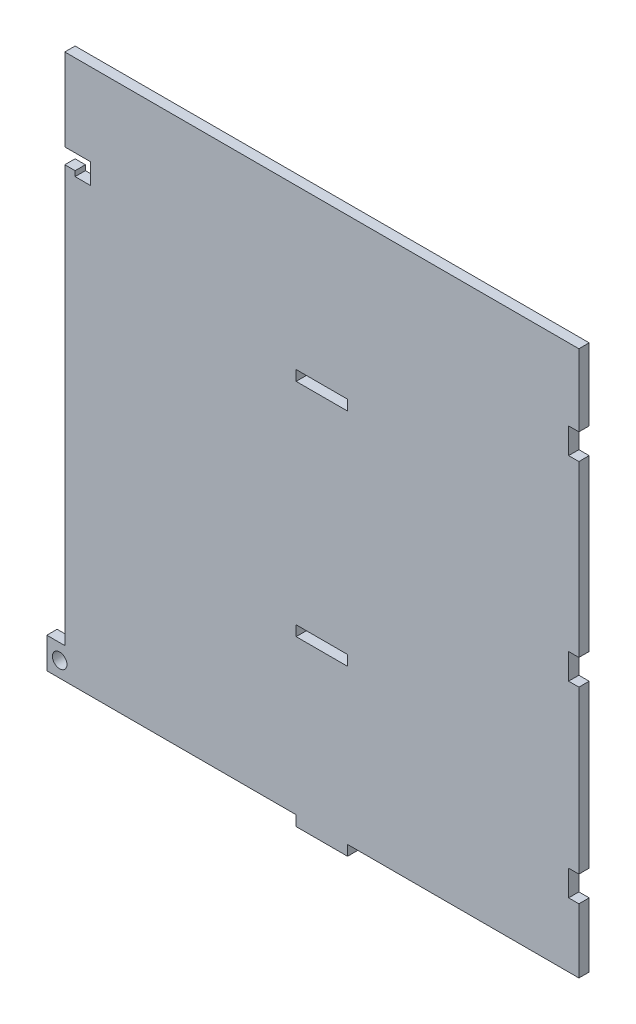
ISO-10303-21;
HEADER;
FILE_DESCRIPTION(('STEP AP214'),'2;1');
FILE_NAME('part.step','',(''),(''),'','','');
FILE_SCHEMA(('AUTOMOTIVE_DESIGN { 1 0 10303 214 1 1 1 1 }'));
ENDSEC;
DATA;
#1=APPLICATION_CONTEXT('core data for automotive mechanical design processes');
#2=APPLICATION_PROTOCOL_DEFINITION('international standard','automotive_design',2000,#1);
#3=PRODUCT_CONTEXT('',#1,'mechanical');
#4=PRODUCT('Part','Part','',(#3));
#5=PRODUCT_RELATED_PRODUCT_CATEGORY('part','',(#4));
#6=PRODUCT_DEFINITION_FORMATION('','',#4);
#7=PRODUCT_DEFINITION_CONTEXT('part definition',#1,'design');
#8=PRODUCT_DEFINITION('design','',#6,#7);
#9=PRODUCT_DEFINITION_SHAPE('','',#8);
#10=(LENGTH_UNIT() NAMED_UNIT(*) SI_UNIT(.MILLI.,.METRE.));
#11=(NAMED_UNIT(*) PLANE_ANGLE_UNIT() SI_UNIT($,.RADIAN.));
#12=(NAMED_UNIT(*) SI_UNIT($,.STERADIAN.) SOLID_ANGLE_UNIT());
#13=UNCERTAINTY_MEASURE_WITH_UNIT(LENGTH_MEASURE(1.E-05),#10,'distance_accuracy_value','');
#14=(GEOMETRIC_REPRESENTATION_CONTEXT(3) GLOBAL_UNCERTAINTY_ASSIGNED_CONTEXT((#13)) GLOBAL_UNIT_ASSIGNED_CONTEXT((#10,
#11,#12)) REPRESENTATION_CONTEXT('',''));
#15=CARTESIAN_POINT('',(0.,0.,0.));
#16=DIRECTION('',(0.,0.,1.));
#17=DIRECTION('',(1.,0.,0.));
#18=AXIS2_PLACEMENT_3D('',#15,#16,#17);
#19=CARTESIAN_POINT('',(0.,75.,2.));
#20=DIRECTION('',(0.,1.,0.));
#21=DIRECTION('',(0.,0.,1.));
#22=AXIS2_PLACEMENT_3D('',#19,#20,#21);
#23=PLANE('',#22);
#24=DIRECTION('',(1.,0.,0.));
#25=VECTOR('',#24,1.);
#26=CARTESIAN_POINT('',(0.,75.,0.));
#27=LINE('',#26,#25);
#28=CARTESIAN_POINT('',(-5.,75.,0.));
#29=VERTEX_POINT('',#28);
#30=CARTESIAN_POINT('',(5.,75.,0.));
#31=VERTEX_POINT('',#30);
#32=EDGE_CURVE('E397',#29,#31,#27,.T.);
#33=ORIENTED_EDGE('',*,*,#32,.T.);
#34=DIRECTION('',(0.,0.,-1.));
#35=VECTOR('',#34,1.);
#36=CARTESIAN_POINT('',(5.,75.,2.));
#37=LINE('',#36,#35);
#38=CARTESIAN_POINT('',(5.,75.,2.));
#39=VERTEX_POINT('',#38);
#40=EDGE_CURVE('E11',#39,#31,#37,.T.);
#41=ORIENTED_EDGE('',*,*,#40,.F.);
#42=DIRECTION('',(1.,0.,0.));
#43=VECTOR('',#42,1.);
#44=CARTESIAN_POINT('',(0.,75.,2.));
#45=LINE('',#44,#43);
#46=CARTESIAN_POINT('',(-5.,75.,2.));
#47=VERTEX_POINT('',#46);
#48=EDGE_CURVE('E283',#47,#39,#45,.T.);
#49=ORIENTED_EDGE('',*,*,#48,.F.);
#50=DIRECTION('',(0.,0.,-1.));
#51=VECTOR('',#50,1.);
#52=CARTESIAN_POINT('',(-5.,75.,2.));
#53=LINE('',#52,#51);
#54=EDGE_CURVE('E55',#47,#29,#53,.T.);
#55=ORIENTED_EDGE('',*,*,#54,.T.);
#56=EDGE_LOOP('',(#33,#41,#49,#55));
#57=FACE_BOUND('',#56,.T.);
#58=ADVANCED_FACE('F36',(#57),#23,.F.);
#59=CARTESIAN_POINT('',(5.00000000000003,0.,2.));
#60=DIRECTION('',(1.,0.,0.));
#61=DIRECTION('',(0.,1.,0.));
#62=AXIS2_PLACEMENT_3D('',#59,#60,#61);
#63=PLANE('',#62);
#64=DIRECTION('',(0.,-1.,0.));
#65=VECTOR('',#64,1.);
#66=CARTESIAN_POINT('',(5.00000000000003,0.,0.));
#67=LINE('',#66,#65);
#68=CARTESIAN_POINT('',(5.,73.,0.));
#69=VERTEX_POINT('',#68);
#70=EDGE_CURVE('E289',#31,#69,#67,.T.);
#71=ORIENTED_EDGE('',*,*,#70,.T.);
#72=DIRECTION('',(0.,0.,-1.));
#73=VECTOR('',#72,1.);
#74=CARTESIAN_POINT('',(5.,73.,2.));
#75=LINE('',#74,#73);
#76=CARTESIAN_POINT('',(5.,73.,2.));
#77=VERTEX_POINT('',#76);
#78=EDGE_CURVE('E46',#77,#69,#75,.T.);
#79=ORIENTED_EDGE('',*,*,#78,.F.);
#80=DIRECTION('',(0.,-1.,0.));
#81=VECTOR('',#80,1.);
#82=CARTESIAN_POINT('',(5.00000000000003,0.,2.));
#83=LINE('',#82,#81);
#84=EDGE_CURVE('E277',#39,#77,#83,.T.);
#85=ORIENTED_EDGE('',*,*,#84,.F.);
#86=ORIENTED_EDGE('',*,*,#40,.T.);
#87=EDGE_LOOP('',(#71,#79,#85,#86));
#88=FACE_BOUND('',#87,.T.);
#89=ADVANCED_FACE('F288',(#88),#63,.F.);
#90=CARTESIAN_POINT('',(0.,73.,2.));
#91=DIRECTION('',(0.,1.,0.));
#92=DIRECTION('',(0.,0.,1.));
#93=AXIS2_PLACEMENT_3D('',#90,#91,#92);
#94=PLANE('',#93);
#95=DIRECTION('',(1.,0.,0.));
#96=VECTOR('',#95,1.);
#97=CARTESIAN_POINT('',(0.,73.,0.));
#98=LINE('',#97,#96);
#99=CARTESIAN_POINT('',(-5.,73.,0.));
#100=VERTEX_POINT('',#99);
#101=EDGE_CURVE('E400',#100,#69,#98,.T.);
#102=ORIENTED_EDGE('',*,*,#101,.F.);
#103=DIRECTION('',(0.,0.,-1.));
#104=VECTOR('',#103,1.);
#105=CARTESIAN_POINT('',(-5.,73.,2.));
#106=LINE('',#105,#104);
#107=CARTESIAN_POINT('',(-5.,73.,2.));
#108=VERTEX_POINT('',#107);
#109=EDGE_CURVE('E165',#108,#100,#106,.T.);
#110=ORIENTED_EDGE('',*,*,#109,.F.);
#111=DIRECTION('',(1.,0.,0.));
#112=VECTOR('',#111,1.);
#113=CARTESIAN_POINT('',(0.,73.,2.));
#114=LINE('',#113,#112);
#115=EDGE_CURVE('E282',#108,#77,#114,.T.);
#116=ORIENTED_EDGE('',*,*,#115,.T.);
#117=ORIENTED_EDGE('',*,*,#78,.T.);
#118=EDGE_LOOP('',(#102,#110,#116,#117));
#119=FACE_BOUND('',#118,.T.);
#120=ADVANCED_FACE('F293',(#119),#94,.T.);
#121=CARTESIAN_POINT('',(0.,32.,2.));
#122=DIRECTION('',(0.,1.,0.));
#123=DIRECTION('',(0.,0.,1.));
#124=AXIS2_PLACEMENT_3D('',#121,#122,#123);
#125=PLANE('',#124);
#126=DIRECTION('',(1.,0.,0.));
#127=VECTOR('',#126,1.);
#128=CARTESIAN_POINT('',(0.,32.,0.));
#129=LINE('',#128,#127);
#130=CARTESIAN_POINT('',(-5.,32.,0.));
#131=VERTEX_POINT('',#130);
#132=CARTESIAN_POINT('',(4.99999999999999,32.,0.));
#133=VERTEX_POINT('',#132);
#134=EDGE_CURVE('E385',#131,#133,#129,.T.);
#135=ORIENTED_EDGE('',*,*,#134,.T.);
#136=DIRECTION('',(0.,0.,-1.));
#137=VECTOR('',#136,1.);
#138=CARTESIAN_POINT('',(4.99999999999999,32.,2.));
#139=LINE('',#138,#137);
#140=CARTESIAN_POINT('',(4.99999999999999,32.,2.));
#141=VERTEX_POINT('',#140);
#142=EDGE_CURVE('E407',#141,#133,#139,.T.);
#143=ORIENTED_EDGE('',*,*,#142,.F.);
#144=DIRECTION('',(1.,0.,0.));
#145=VECTOR('',#144,1.);
#146=CARTESIAN_POINT('',(0.,32.,2.));
#147=LINE('',#146,#145);
#148=CARTESIAN_POINT('',(-5.,32.,2.));
#149=VERTEX_POINT('',#148);
#150=EDGE_CURVE('E580',#149,#141,#147,.T.);
#151=ORIENTED_EDGE('',*,*,#150,.F.);
#152=DIRECTION('',(0.,0.,-1.));
#153=VECTOR('',#152,1.);
#154=CARTESIAN_POINT('',(-5.,32.,2.));
#155=LINE('',#154,#153);
#156=EDGE_CURVE('E409',#149,#131,#155,.T.);
#157=ORIENTED_EDGE('',*,*,#156,.T.);
#158=EDGE_LOOP('',(#135,#143,#151,#157));
#159=FACE_BOUND('',#158,.T.);
#160=ADVANCED_FACE('F604',(#159),#125,.F.);
#161=CARTESIAN_POINT('',(4.99999999999999,0.,2.));
#162=DIRECTION('',(1.,0.,0.));
#163=DIRECTION('',(0.,0.,-1.));
#164=AXIS2_PLACEMENT_3D('',#161,#162,#163);
#165=PLANE('',#164);
#166=DIRECTION('',(0.,-1.,0.));
#167=VECTOR('',#166,1.);
#168=CARTESIAN_POINT('',(4.99999999999999,0.,0.));
#169=LINE('',#168,#167);
#170=CARTESIAN_POINT('',(4.99999999999999,30.,0.));
#171=VERTEX_POINT('',#170);
#172=EDGE_CURVE('E388',#133,#171,#169,.T.);
#173=ORIENTED_EDGE('',*,*,#172,.T.);
#174=DIRECTION('',(0.,0.,-1.));
#175=VECTOR('',#174,1.);
#176=CARTESIAN_POINT('',(4.99999999999999,30.,2.));
#177=LINE('',#176,#175);
#178=CARTESIAN_POINT('',(4.99999999999999,30.,2.));
#179=VERTEX_POINT('',#178);
#180=EDGE_CURVE('E413',#179,#171,#177,.T.);
#181=ORIENTED_EDGE('',*,*,#180,.F.);
#182=DIRECTION('',(0.,-1.,0.));
#183=VECTOR('',#182,1.);
#184=CARTESIAN_POINT('',(4.99999999999999,0.,2.));
#185=LINE('',#184,#183);
#186=EDGE_CURVE('E583',#141,#179,#185,.T.);
#187=ORIENTED_EDGE('',*,*,#186,.F.);
#188=ORIENTED_EDGE('',*,*,#142,.T.);
#189=EDGE_LOOP('',(#173,#181,#187,#188));
#190=FACE_BOUND('',#189,.T.);
#191=ADVANCED_FACE('F606',(#190),#165,.F.);
#192=CARTESIAN_POINT('',(0.,30.,2.));
#193=DIRECTION('',(0.,1.,0.));
#194=DIRECTION('',(0.,0.,1.));
#195=AXIS2_PLACEMENT_3D('',#192,#193,#194);
#196=PLANE('',#195);
#197=DIRECTION('',(1.,0.,0.));
#198=VECTOR('',#197,1.);
#199=CARTESIAN_POINT('',(0.,30.,0.));
#200=LINE('',#199,#198);
#201=CARTESIAN_POINT('',(-5.,30.,0.));
#202=VERTEX_POINT('',#201);
#203=EDGE_CURVE('E391',#202,#171,#200,.T.);
#204=ORIENTED_EDGE('',*,*,#203,.F.);
#205=DIRECTION('',(0.,0.,-1.));
#206=VECTOR('',#205,1.);
#207=CARTESIAN_POINT('',(-5.,30.,2.));
#208=LINE('',#207,#206);
#209=CARTESIAN_POINT('',(-5.,30.,2.));
#210=VERTEX_POINT('',#209);
#211=EDGE_CURVE('E411',#210,#202,#208,.T.);
#212=ORIENTED_EDGE('',*,*,#211,.F.);
#213=DIRECTION('',(1.,0.,0.));
#214=VECTOR('',#213,1.);
#215=CARTESIAN_POINT('',(0.,30.,2.));
#216=LINE('',#215,#214);
#217=EDGE_CURVE('E585',#210,#179,#216,.T.);
#218=ORIENTED_EDGE('',*,*,#217,.T.);
#219=ORIENTED_EDGE('',*,*,#180,.T.);
#220=EDGE_LOOP('',(#204,#212,#218,#219));
#221=FACE_BOUND('',#220,.T.);
#222=ADVANCED_FACE('F600',(#221),#196,.T.);
#223=CARTESIAN_POINT('',(-45.,0.,2.));
#224=DIRECTION('',(-1.,0.,0.));
#225=DIRECTION('',(0.,0.,1.));
#226=AXIS2_PLACEMENT_3D('',#223,#224,#225);
#227=PLANE('',#226);
#228=DIRECTION('',(0.,1.,0.));
#229=VECTOR('',#228,1.);
#230=CARTESIAN_POINT('',(-45.,0.,0.));
#231=LINE('',#230,#229);
#232=CARTESIAN_POINT('',(-45.,86.,0.));
#233=VERTEX_POINT('',#232);
#234=CARTESIAN_POINT('',(-45.,90.,0.));
#235=VERTEX_POINT('',#234);
#236=EDGE_CURVE('E303',#233,#235,#231,.T.);
#237=ORIENTED_EDGE('',*,*,#236,.F.);
#238=DIRECTION('',(0.,0.,-1.));
#239=VECTOR('',#238,1.);
#240=CARTESIAN_POINT('',(-45.,86.,2.));
#241=LINE('',#240,#239);
#242=CARTESIAN_POINT('',(-45.,86.,2.));
#243=VERTEX_POINT('',#242);
#244=EDGE_CURVE('E40',#243,#233,#241,.T.);
#245=ORIENTED_EDGE('',*,*,#244,.F.);
#246=DIRECTION('',(0.,1.,0.));
#247=VECTOR('',#246,1.);
#248=CARTESIAN_POINT('',(-45.,0.,2.));
#249=LINE('',#248,#247);
#250=CARTESIAN_POINT('',(-45.,90.,2.));
#251=VERTEX_POINT('',#250);
#252=EDGE_CURVE('E1035',#243,#251,#249,.T.);
#253=ORIENTED_EDGE('',*,*,#252,.T.);
#254=DIRECTION('',(0.,0.,-1.));
#255=VECTOR('',#254,1.);
#256=CARTESIAN_POINT('',(-45.,90.,2.));
#257=LINE('',#256,#255);
#258=EDGE_CURVE('E296',#251,#235,#257,.T.);
#259=ORIENTED_EDGE('',*,*,#258,.T.);
#260=EDGE_LOOP('',(#237,#245,#253,#259));
#261=FACE_BOUND('',#260,.T.);
#262=ADVANCED_FACE('F491',(#261),#227,.T.);
#263=CARTESIAN_POINT('',(0.,86.,2.));
#264=DIRECTION('',(0.,1.,0.));
#265=DIRECTION('',(0.,0.,1.));
#266=AXIS2_PLACEMENT_3D('',#263,#264,#265);
#267=PLANE('',#266);
#268=DIRECTION('',(1.,0.,0.));
#269=VECTOR('',#268,1.);
#270=CARTESIAN_POINT('',(0.,86.,0.));
#271=LINE('',#270,#269);
#272=CARTESIAN_POINT('',(-48.,86.,0.));
#273=VERTEX_POINT('',#272);
#274=EDGE_CURVE('E306',#273,#233,#271,.T.);
#275=ORIENTED_EDGE('',*,*,#274,.F.);
#276=DIRECTION('',(0.,0.,-1.));
#277=VECTOR('',#276,1.);
#278=CARTESIAN_POINT('',(-48.,86.,2.));
#279=LINE('',#278,#277);
#280=CARTESIAN_POINT('',(-48.,86.,2.));
#281=VERTEX_POINT('',#280);
#282=EDGE_CURVE('E481',#281,#273,#279,.T.);
#283=ORIENTED_EDGE('',*,*,#282,.F.);
#284=DIRECTION('',(1.,0.,0.));
#285=VECTOR('',#284,1.);
#286=CARTESIAN_POINT('',(0.,86.,2.));
#287=LINE('',#286,#285);
#288=EDGE_CURVE('E490',#281,#243,#287,.T.);
#289=ORIENTED_EDGE('',*,*,#288,.T.);
#290=ORIENTED_EDGE('',*,*,#244,.T.);
#291=EDGE_LOOP('',(#275,#283,#289,#290));
#292=FACE_BOUND('',#291,.T.);
#293=ADVANCED_FACE('F488',(#292),#267,.T.);
#294=CARTESIAN_POINT('',(-48.,0.,2.));
#295=DIRECTION('',(1.,0.,0.));
#296=DIRECTION('',(0.,0.,-1.));
#297=AXIS2_PLACEMENT_3D('',#294,#295,#296);
#298=PLANE('',#297);
#299=DIRECTION('',(0.,-1.,0.));
#300=VECTOR('',#299,1.);
#301=CARTESIAN_POINT('',(-48.,0.,0.));
#302=LINE('',#301,#300);
#303=CARTESIAN_POINT('',(-48.,87.,0.));
#304=VERTEX_POINT('',#303);
#305=EDGE_CURVE('E309',#304,#273,#302,.T.);
#306=ORIENTED_EDGE('',*,*,#305,.F.);
#307=DIRECTION('',(0.,0.,-1.));
#308=VECTOR('',#307,1.);
#309=CARTESIAN_POINT('',(-48.,87.,2.));
#310=LINE('',#309,#308);
#311=CARTESIAN_POINT('',(-48.,87.,2.));
#312=VERTEX_POINT('',#311);
#313=EDGE_CURVE('E480',#312,#304,#310,.T.);
#314=ORIENTED_EDGE('',*,*,#313,.F.);
#315=DIRECTION('',(0.,-1.,0.));
#316=VECTOR('',#315,1.);
#317=CARTESIAN_POINT('',(-48.,0.,2.));
#318=LINE('',#317,#316);
#319=EDGE_CURVE('E499',#312,#281,#318,.T.);
#320=ORIENTED_EDGE('',*,*,#319,.T.);
#321=ORIENTED_EDGE('',*,*,#282,.T.);
#322=EDGE_LOOP('',(#306,#314,#320,#321));
#323=FACE_BOUND('',#322,.T.);
#324=ADVANCED_FACE('F497',(#323),#298,.T.);
#325=CARTESIAN_POINT('',(0.,87.,2.));
#326=DIRECTION('',(0.,1.,0.));
#327=DIRECTION('',(0.,0.,1.));
#328=AXIS2_PLACEMENT_3D('',#325,#326,#327);
#329=PLANE('',#328);
#330=DIRECTION('',(1.,0.,0.));
#331=VECTOR('',#330,1.);
#332=CARTESIAN_POINT('',(0.,87.,0.));
#333=LINE('',#332,#331);
#334=CARTESIAN_POINT('',(-50.,87.,0.));
#335=VERTEX_POINT('',#334);
#336=EDGE_CURVE('E312',#335,#304,#333,.T.);
#337=ORIENTED_EDGE('',*,*,#336,.F.);
#338=DIRECTION('',(0.,0.,-1.));
#339=VECTOR('',#338,1.);
#340=CARTESIAN_POINT('',(-50.,87.,2.));
#341=LINE('',#340,#339);
#342=CARTESIAN_POINT('',(-50.,87.,2.));
#343=VERTEX_POINT('',#342);
#344=EDGE_CURVE('E478',#343,#335,#341,.T.);
#345=ORIENTED_EDGE('',*,*,#344,.F.);
#346=DIRECTION('',(1.,0.,0.));
#347=VECTOR('',#346,1.);
#348=CARTESIAN_POINT('',(0.,87.,2.));
#349=LINE('',#348,#347);
#350=EDGE_CURVE('E506',#343,#312,#349,.T.);
#351=ORIENTED_EDGE('',*,*,#350,.T.);
#352=ORIENTED_EDGE('',*,*,#313,.T.);
#353=EDGE_LOOP('',(#337,#345,#351,#352));
#354=FACE_BOUND('',#353,.T.);
#355=ADVANCED_FACE('F509',(#354),#329,.T.);
#356=CARTESIAN_POINT('',(-50.,0.,2.));
#357=DIRECTION('',(-1.,0.,0.));
#358=DIRECTION('',(0.,0.,1.));
#359=AXIS2_PLACEMENT_3D('',#356,#357,#358);
#360=PLANE('',#359);
#361=DIRECTION('',(0.,1.,0.));
#362=VECTOR('',#361,1.);
#363=CARTESIAN_POINT('',(-50.,0.,0.));
#364=LINE('',#363,#362);
#365=CARTESIAN_POINT('',(-50.,6.,0.));
#366=VERTEX_POINT('',#365);
#367=EDGE_CURVE('E315',#366,#335,#364,.T.);
#368=ORIENTED_EDGE('',*,*,#367,.F.);
#369=DIRECTION('',(0.,0.,-1.));
#370=VECTOR('',#369,1.);
#371=CARTESIAN_POINT('',(-50.,6.,2.));
#372=LINE('',#371,#370);
#373=CARTESIAN_POINT('',(-50.,6.,2.));
#374=VERTEX_POINT('',#373);
#375=EDGE_CURVE('E476',#374,#366,#372,.T.);
#376=ORIENTED_EDGE('',*,*,#375,.F.);
#377=DIRECTION('',(0.,1.,0.));
#378=VECTOR('',#377,1.);
#379=CARTESIAN_POINT('',(-50.,0.,2.));
#380=LINE('',#379,#378);
#381=EDGE_CURVE('E510',#374,#343,#380,.T.);
#382=ORIENTED_EDGE('',*,*,#381,.T.);
#383=ORIENTED_EDGE('',*,*,#344,.T.);
#384=EDGE_LOOP('',(#368,#376,#382,#383));
#385=FACE_BOUND('',#384,.T.);
#386=ADVANCED_FACE('F718',(#385),#360,.T.);
#387=CARTESIAN_POINT('',(0.,6.,2.));
#388=DIRECTION('',(0.,1.,0.));
#389=DIRECTION('',(0.,0.,1.));
#390=AXIS2_PLACEMENT_3D('',#387,#388,#389);
#391=PLANE('',#390);
#392=DIRECTION('',(1.,0.,0.));
#393=VECTOR('',#392,1.);
#394=CARTESIAN_POINT('',(0.,6.,0.));
#395=LINE('',#394,#393);
#396=CARTESIAN_POINT('',(-53.5,6.,0.));
#397=VERTEX_POINT('',#396);
#398=EDGE_CURVE('E318',#397,#366,#395,.T.);
#399=ORIENTED_EDGE('',*,*,#398,.F.);
#400=DIRECTION('',(0.,0.,-1.));
#401=VECTOR('',#400,1.);
#402=CARTESIAN_POINT('',(-53.5,6.,2.));
#403=LINE('',#402,#401);
#404=CARTESIAN_POINT('',(-53.5,6.,2.));
#405=VERTEX_POINT('',#404);
#406=EDGE_CURVE('E474',#405,#397,#403,.T.);
#407=ORIENTED_EDGE('',*,*,#406,.F.);
#408=DIRECTION('',(1.,0.,0.));
#409=VECTOR('',#408,1.);
#410=CARTESIAN_POINT('',(0.,6.,2.));
#411=LINE('',#410,#409);
#412=EDGE_CURVE('E512',#405,#374,#411,.T.);
#413=ORIENTED_EDGE('',*,*,#412,.T.);
#414=ORIENTED_EDGE('',*,*,#375,.T.);
#415=EDGE_LOOP('',(#399,#407,#413,#414));
#416=FACE_BOUND('',#415,.T.);
#417=ADVANCED_FACE('F714',(#416),#391,.T.);
#418=CARTESIAN_POINT('',(-53.5,0.,2.));
#419=DIRECTION('',(-1.,0.,0.));
#420=DIRECTION('',(0.,0.,1.));
#421=AXIS2_PLACEMENT_3D('',#418,#419,#420);
#422=PLANE('',#421);
#423=DIRECTION('',(0.,1.,0.));
#424=VECTOR('',#423,1.);
#425=CARTESIAN_POINT('',(-53.5,0.,0.));
#426=LINE('',#425,#424);
#427=CARTESIAN_POINT('',(-53.5,0.,0.));
#428=VERTEX_POINT('',#427);
#429=EDGE_CURVE('E321',#428,#397,#426,.T.);
#430=ORIENTED_EDGE('',*,*,#429,.F.);
#431=DIRECTION('',(0.,0.,-1.));
#432=VECTOR('',#431,1.);
#433=CARTESIAN_POINT('',(-53.5,0.,2.));
#434=LINE('',#433,#432);
#435=CARTESIAN_POINT('',(-53.5,0.,2.));
#436=VERTEX_POINT('',#435);
#437=EDGE_CURVE('E472',#436,#428,#434,.T.);
#438=ORIENTED_EDGE('',*,*,#437,.F.);
#439=DIRECTION('',(0.,1.,0.));
#440=VECTOR('',#439,1.);
#441=CARTESIAN_POINT('',(-53.5,0.,2.));
#442=LINE('',#441,#440);
#443=EDGE_CURVE('E518',#436,#405,#442,.T.);
#444=ORIENTED_EDGE('',*,*,#443,.T.);
#445=ORIENTED_EDGE('',*,*,#406,.T.);
#446=EDGE_LOOP('',(#430,#438,#444,#445));
#447=FACE_BOUND('',#446,.T.);
#448=ADVANCED_FACE('F711',(#447),#422,.T.);
#449=CARTESIAN_POINT('',(0.,0.,2.));
#450=DIRECTION('',(0.,-1.,0.));
#451=DIRECTION('',(0.,0.,-1.));
#452=AXIS2_PLACEMENT_3D('',#449,#450,#451);
#453=PLANE('',#452);
#454=DIRECTION('',(-1.,0.,0.));
#455=VECTOR('',#454,1.);
#456=CARTESIAN_POINT('',(0.,0.,0.));
#457=LINE('',#456,#455);
#458=CARTESIAN_POINT('',(-5.,0.,0.));
#459=VERTEX_POINT('',#458);
#460=EDGE_CURVE('E324',#459,#428,#457,.T.);
#461=ORIENTED_EDGE('',*,*,#460,.F.);
#462=DIRECTION('',(0.,0.,-1.));
#463=VECTOR('',#462,1.);
#464=CARTESIAN_POINT('',(-5.,0.,2.));
#465=LINE('',#464,#463);
#466=CARTESIAN_POINT('',(-5.,0.,2.));
#467=VERTEX_POINT('',#466);
#468=EDGE_CURVE('E470',#467,#459,#465,.T.);
#469=ORIENTED_EDGE('',*,*,#468,.F.);
#470=DIRECTION('',(-1.,0.,0.));
#471=VECTOR('',#470,1.);
#472=CARTESIAN_POINT('',(0.,0.,2.));
#473=LINE('',#472,#471);
#474=EDGE_CURVE('E521',#467,#436,#473,.T.);
#475=ORIENTED_EDGE('',*,*,#474,.T.);
#476=ORIENTED_EDGE('',*,*,#437,.T.);
#477=EDGE_LOOP('',(#461,#469,#475,#476));
#478=FACE_BOUND('',#477,.T.);
#479=ADVANCED_FACE('F699',(#478),#453,.T.);
#480=CARTESIAN_POINT('',(-5.,0.,2.));
#481=DIRECTION('',(1.,0.,0.));
#482=DIRECTION('',(0.,0.,-1.));
#483=AXIS2_PLACEMENT_3D('',#480,#481,#482);
#484=PLANE('',#483);
#485=DIRECTION('',(0.,-1.,0.));
#486=VECTOR('',#485,1.);
#487=CARTESIAN_POINT('',(-5.,0.,0.));
#488=LINE('',#487,#486);
#489=CARTESIAN_POINT('',(-5.,-2.,0.));
#490=VERTEX_POINT('',#489);
#491=EDGE_CURVE('E327',#459,#490,#488,.T.);
#492=ORIENTED_EDGE('',*,*,#491,.T.);
#493=DIRECTION('',(0.,0.,-1.));
#494=VECTOR('',#493,1.);
#495=CARTESIAN_POINT('',(-5.,-2.,2.));
#496=LINE('',#495,#494);
#497=CARTESIAN_POINT('',(-5.,-2.,2.));
#498=VERTEX_POINT('',#497);
#499=EDGE_CURVE('E467',#498,#490,#496,.T.);
#500=ORIENTED_EDGE('',*,*,#499,.F.);
#501=DIRECTION('',(0.,-1.,0.));
#502=VECTOR('',#501,1.);
#503=CARTESIAN_POINT('',(-5.,0.,2.));
#504=LINE('',#503,#502);
#505=EDGE_CURVE('E524',#467,#498,#504,.T.);
#506=ORIENTED_EDGE('',*,*,#505,.F.);
#507=ORIENTED_EDGE('',*,*,#468,.T.);
#508=EDGE_LOOP('',(#492,#500,#506,#507));
#509=FACE_BOUND('',#508,.T.);
#510=ADVANCED_FACE('F706',(#509),#484,.F.);
#511=CARTESIAN_POINT('',(0.,-2.,2.));
#512=DIRECTION('',(0.,1.,0.));
#513=DIRECTION('',(-1.,0.,0.));
#514=AXIS2_PLACEMENT_3D('',#511,#512,#513);
#515=PLANE('',#514);
#516=DIRECTION('',(1.,0.,0.));
#517=VECTOR('',#516,1.);
#518=CARTESIAN_POINT('',(0.,-2.,0.));
#519=LINE('',#518,#517);
#520=CARTESIAN_POINT('',(5.,-2.,0.));
#521=VERTEX_POINT('',#520);
#522=EDGE_CURVE('E331',#490,#521,#519,.T.);
#523=ORIENTED_EDGE('',*,*,#522,.T.);
#524=DIRECTION('',(0.,0.,-1.));
#525=VECTOR('',#524,1.);
#526=CARTESIAN_POINT('',(5.,-2.,2.));
#527=LINE('',#526,#525);
#528=CARTESIAN_POINT('',(5.,-2.,2.));
#529=VERTEX_POINT('',#528);
#530=EDGE_CURVE('E464',#529,#521,#527,.T.);
#531=ORIENTED_EDGE('',*,*,#530,.F.);
#532=DIRECTION('',(1.,0.,0.));
#533=VECTOR('',#532,1.);
#534=CARTESIAN_POINT('',(0.,-2.,2.));
#535=LINE('',#534,#533);
#536=EDGE_CURVE('E528',#498,#529,#535,.T.);
#537=ORIENTED_EDGE('',*,*,#536,.F.);
#538=ORIENTED_EDGE('',*,*,#499,.T.);
#539=EDGE_LOOP('',(#523,#531,#537,#538));
#540=FACE_BOUND('',#539,.T.);
#541=ADVANCED_FACE('F702',(#540),#515,.F.);
#542=CARTESIAN_POINT('',(5.,0.,2.));
#543=DIRECTION('',(-1.,0.,0.));
#544=DIRECTION('',(0.,0.,1.));
#545=AXIS2_PLACEMENT_3D('',#542,#543,#544);
#546=PLANE('',#545);
#547=DIRECTION('',(0.,1.,0.));
#548=VECTOR('',#547,1.);
#549=CARTESIAN_POINT('',(5.,0.,0.));
#550=LINE('',#549,#548);
#551=CARTESIAN_POINT('',(5.,0.,0.));
#552=VERTEX_POINT('',#551);
#553=EDGE_CURVE('E334',#521,#552,#550,.T.);
#554=ORIENTED_EDGE('',*,*,#553,.T.);
#555=DIRECTION('',(0.,0.,-1.));
#556=VECTOR('',#555,1.);
#557=CARTESIAN_POINT('',(5.,0.,2.));
#558=LINE('',#557,#556);
#559=CARTESIAN_POINT('',(5.,0.,2.));
#560=VERTEX_POINT('',#559);
#561=EDGE_CURVE('E462',#560,#552,#558,.T.);
#562=ORIENTED_EDGE('',*,*,#561,.F.);
#563=DIRECTION('',(0.,1.,0.));
#564=VECTOR('',#563,1.);
#565=CARTESIAN_POINT('',(5.,0.,2.));
#566=LINE('',#565,#564);
#567=EDGE_CURVE('E531',#529,#560,#566,.T.);
#568=ORIENTED_EDGE('',*,*,#567,.F.);
#569=ORIENTED_EDGE('',*,*,#530,.T.);
#570=EDGE_LOOP('',(#554,#562,#568,#569));
#571=FACE_BOUND('',#570,.T.);
#572=ADVANCED_FACE('F697',(#571),#546,.F.);
#573=CARTESIAN_POINT('',(50.,0.,0.));
#574=VERTEX_POINT('',#573);
#575=EDGE_CURVE('E328',#574,#552,#457,.T.);
#576=ORIENTED_EDGE('',*,*,#575,.F.);
#577=DIRECTION('',(0.,0.,-1.));
#578=VECTOR('',#577,1.);
#579=CARTESIAN_POINT('',(50.,0.,2.));
#580=LINE('',#579,#578);
#581=CARTESIAN_POINT('',(50.,0.,2.));
#582=VERTEX_POINT('',#581);
#583=EDGE_CURVE('E460',#582,#574,#580,.T.);
#584=ORIENTED_EDGE('',*,*,#583,.F.);
#585=EDGE_CURVE('E525',#582,#560,#473,.T.);
#586=ORIENTED_EDGE('',*,*,#585,.T.);
#587=ORIENTED_EDGE('',*,*,#561,.T.);
#588=EDGE_LOOP('',(#576,#584,#586,#587));
#589=FACE_BOUND('',#588,.T.);
#590=ADVANCED_FACE('F693',(#589),#453,.T.);
#591=CARTESIAN_POINT('',(50.,0.,2.));
#592=DIRECTION('',(-1.,0.,0.));
#593=DIRECTION('',(0.,0.,1.));
#594=AXIS2_PLACEMENT_3D('',#591,#592,#593);
#595=PLANE('',#594);
#596=DIRECTION('',(0.,1.,0.));
#597=VECTOR('',#596,1.);
#598=CARTESIAN_POINT('',(50.,0.,0.));
#599=LINE('',#598,#597);
#600=CARTESIAN_POINT('',(50.,12.5,0.));
#601=VERTEX_POINT('',#600);
#602=EDGE_CURVE('E337',#574,#601,#599,.T.);
#603=ORIENTED_EDGE('',*,*,#602,.T.);
#604=DIRECTION('',(0.,0.,-1.));
#605=VECTOR('',#604,1.);
#606=CARTESIAN_POINT('',(50.,12.5,2.));
#607=LINE('',#606,#605);
#608=CARTESIAN_POINT('',(50.,12.5,2.));
#609=VERTEX_POINT('',#608);
#610=EDGE_CURVE('E457',#609,#601,#607,.T.);
#611=ORIENTED_EDGE('',*,*,#610,.F.);
#612=DIRECTION('',(0.,1.,0.));
#613=VECTOR('',#612,1.);
#614=CARTESIAN_POINT('',(50.,0.,2.));
#615=LINE('',#614,#613);
#616=EDGE_CURVE('E533',#582,#609,#615,.T.);
#617=ORIENTED_EDGE('',*,*,#616,.F.);
#618=ORIENTED_EDGE('',*,*,#583,.T.);
#619=EDGE_LOOP('',(#603,#611,#617,#618));
#620=FACE_BOUND('',#619,.T.);
#621=ADVANCED_FACE('F689',(#620),#595,.F.);
#622=CARTESIAN_POINT('',(0.,12.4999999999999,2.));
#623=DIRECTION('',(0.,-1.,0.));
#624=DIRECTION('',(1.,0.,0.));
#625=AXIS2_PLACEMENT_3D('',#622,#623,#624);
#626=PLANE('',#625);
#627=DIRECTION('',(-1.,0.,0.));
#628=VECTOR('',#627,1.);
#629=CARTESIAN_POINT('',(0.,12.4999999999999,0.));
#630=LINE('',#629,#628);
#631=CARTESIAN_POINT('',(48.,12.5,0.));
#632=VERTEX_POINT('',#631);
#633=EDGE_CURVE('E340',#601,#632,#630,.T.);
#634=ORIENTED_EDGE('',*,*,#633,.T.);
#635=DIRECTION('',(0.,0.,-1.));
#636=VECTOR('',#635,1.);
#637=CARTESIAN_POINT('',(48.,12.5,2.));
#638=LINE('',#637,#636);
#639=CARTESIAN_POINT('',(48.,12.5,2.));
#640=VERTEX_POINT('',#639);
#641=EDGE_CURVE('E454',#640,#632,#638,.T.);
#642=ORIENTED_EDGE('',*,*,#641,.F.);
#643=DIRECTION('',(-1.,0.,0.));
#644=VECTOR('',#643,1.);
#645=CARTESIAN_POINT('',(0.,12.4999999999999,2.));
#646=LINE('',#645,#644);
#647=EDGE_CURVE('E536',#609,#640,#646,.T.);
#648=ORIENTED_EDGE('',*,*,#647,.F.);
#649=ORIENTED_EDGE('',*,*,#610,.T.);
#650=EDGE_LOOP('',(#634,#642,#648,#649));
#651=FACE_BOUND('',#650,.T.);
#652=ADVANCED_FACE('F685',(#651),#626,.F.);
#653=CARTESIAN_POINT('',(48.,0.,2.));
#654=DIRECTION('',(-1.,0.,0.));
#655=DIRECTION('',(0.,0.,1.));
#656=AXIS2_PLACEMENT_3D('',#653,#654,#655);
#657=PLANE('',#656);
#658=DIRECTION('',(0.,1.,0.));
#659=VECTOR('',#658,1.);
#660=CARTESIAN_POINT('',(48.,0.,0.));
#661=LINE('',#660,#659);
#662=CARTESIAN_POINT('',(48.,17.5,0.));
#663=VERTEX_POINT('',#662);
#664=EDGE_CURVE('E343',#632,#663,#661,.T.);
#665=ORIENTED_EDGE('',*,*,#664,.T.);
#666=DIRECTION('',(0.,0.,-1.));
#667=VECTOR('',#666,1.);
#668=CARTESIAN_POINT('',(48.,17.5,2.));
#669=LINE('',#668,#667);
#670=CARTESIAN_POINT('',(48.,17.5,2.));
#671=VERTEX_POINT('',#670);
#672=EDGE_CURVE('E451',#671,#663,#669,.T.);
#673=ORIENTED_EDGE('',*,*,#672,.F.);
#674=DIRECTION('',(0.,1.,0.));
#675=VECTOR('',#674,1.);
#676=CARTESIAN_POINT('',(48.,0.,2.));
#677=LINE('',#676,#675);
#678=EDGE_CURVE('E539',#640,#671,#677,.T.);
#679=ORIENTED_EDGE('',*,*,#678,.F.);
#680=ORIENTED_EDGE('',*,*,#641,.T.);
#681=EDGE_LOOP('',(#665,#673,#679,#680));
#682=FACE_BOUND('',#681,.T.);
#683=ADVANCED_FACE('F681',(#682),#657,.F.);
#684=CARTESIAN_POINT('',(0.,17.5,2.));
#685=DIRECTION('',(0.,1.,0.));
#686=DIRECTION('',(0.,0.,1.));
#687=AXIS2_PLACEMENT_3D('',#684,#685,#686);
#688=PLANE('',#687);
#689=DIRECTION('',(1.,0.,0.));
#690=VECTOR('',#689,1.);
#691=CARTESIAN_POINT('',(0.,17.5,0.));
#692=LINE('',#691,#690);
#693=CARTESIAN_POINT('',(50.,17.5,0.));
#694=VERTEX_POINT('',#693);
#695=EDGE_CURVE('E346',#663,#694,#692,.T.);
#696=ORIENTED_EDGE('',*,*,#695,.T.);
#697=DIRECTION('',(0.,0.,-1.));
#698=VECTOR('',#697,1.);
#699=CARTESIAN_POINT('',(50.,17.5,2.));
#700=LINE('',#699,#698);
#701=CARTESIAN_POINT('',(50.,17.5,2.));
#702=VERTEX_POINT('',#701);
#703=EDGE_CURVE('E448',#702,#694,#700,.T.);
#704=ORIENTED_EDGE('',*,*,#703,.F.);
#705=DIRECTION('',(1.,0.,0.));
#706=VECTOR('',#705,1.);
#707=CARTESIAN_POINT('',(0.,17.5,2.));
#708=LINE('',#707,#706);
#709=EDGE_CURVE('E542',#671,#702,#708,.T.);
#710=ORIENTED_EDGE('',*,*,#709,.F.);
#711=ORIENTED_EDGE('',*,*,#672,.T.);
#712=EDGE_LOOP('',(#696,#704,#710,#711));
#713=FACE_BOUND('',#712,.T.);
#714=ADVANCED_FACE('F677',(#713),#688,.F.);
#715=CARTESIAN_POINT('',(50.,0.,2.));
#716=DIRECTION('',(-1.,0.,0.));
#717=DIRECTION('',(0.,0.,1.));
#718=AXIS2_PLACEMENT_3D('',#715,#716,#717);
#719=PLANE('',#718);
#720=DIRECTION('',(0.,1.,0.));
#721=VECTOR('',#720,1.);
#722=CARTESIAN_POINT('',(50.,0.,0.));
#723=LINE('',#722,#721);
#724=CARTESIAN_POINT('',(50.,49.,0.));
#725=VERTEX_POINT('',#724);
#726=EDGE_CURVE('E349',#694,#725,#723,.T.);
#727=ORIENTED_EDGE('',*,*,#726,.T.);
#728=DIRECTION('',(0.,0.,-1.));
#729=VECTOR('',#728,1.);
#730=CARTESIAN_POINT('',(50.,49.,2.));
#731=LINE('',#730,#729);
#732=CARTESIAN_POINT('',(50.,49.,2.));
#733=VERTEX_POINT('',#732);
#734=EDGE_CURVE('E445',#733,#725,#731,.T.);
#735=ORIENTED_EDGE('',*,*,#734,.F.);
#736=DIRECTION('',(0.,1.,0.));
#737=VECTOR('',#736,1.);
#738=CARTESIAN_POINT('',(50.,0.,2.));
#739=LINE('',#738,#737);
#740=EDGE_CURVE('E545',#702,#733,#739,.T.);
#741=ORIENTED_EDGE('',*,*,#740,.F.);
#742=ORIENTED_EDGE('',*,*,#703,.T.);
#743=EDGE_LOOP('',(#727,#735,#741,#742));
#744=FACE_BOUND('',#743,.T.);
#745=ADVANCED_FACE('F673',(#744),#719,.F.);
#746=CARTESIAN_POINT('',(-1.70002900645726E-13,48.9999999999998,2.));
#747=DIRECTION('',(0.,-1.,0.));
#748=DIRECTION('',(1.,0.,0.));
#749=AXIS2_PLACEMENT_3D('',#746,#747,#748);
#750=PLANE('',#749);
#751=DIRECTION('',(-1.,0.,0.));
#752=VECTOR('',#751,1.);
#753=CARTESIAN_POINT('',(-1.70002900645726E-13,48.9999999999998,0.));
#754=LINE('',#753,#752);
#755=CARTESIAN_POINT('',(48.,49.,0.));
#756=VERTEX_POINT('',#755);
#757=EDGE_CURVE('E352',#725,#756,#754,.T.);
#758=ORIENTED_EDGE('',*,*,#757,.T.);
#759=DIRECTION('',(0.,0.,-1.));
#760=VECTOR('',#759,1.);
#761=CARTESIAN_POINT('',(48.,49.,2.));
#762=LINE('',#761,#760);
#763=CARTESIAN_POINT('',(48.,49.,2.));
#764=VERTEX_POINT('',#763);
#765=EDGE_CURVE('E442',#764,#756,#762,.T.);
#766=ORIENTED_EDGE('',*,*,#765,.F.);
#767=DIRECTION('',(-1.,0.,0.));
#768=VECTOR('',#767,1.);
#769=CARTESIAN_POINT('',(-1.70002900645726E-13,48.9999999999998,2.));
#770=LINE('',#769,#768);
#771=EDGE_CURVE('E548',#733,#764,#770,.T.);
#772=ORIENTED_EDGE('',*,*,#771,.F.);
#773=ORIENTED_EDGE('',*,*,#734,.T.);
#774=EDGE_LOOP('',(#758,#766,#772,#773));
#775=FACE_BOUND('',#774,.T.);
#776=ADVANCED_FACE('F669',(#775),#750,.F.);
#777=CARTESIAN_POINT('',(48.,0.,2.));
#778=DIRECTION('',(-1.,0.,0.));
#779=DIRECTION('',(0.,0.,1.));
#780=AXIS2_PLACEMENT_3D('',#777,#778,#779);
#781=PLANE('',#780);
#782=DIRECTION('',(0.,1.,0.));
#783=VECTOR('',#782,1.);
#784=CARTESIAN_POINT('',(48.,0.,0.));
#785=LINE('',#784,#783);
#786=CARTESIAN_POINT('',(48.,54.,0.));
#787=VERTEX_POINT('',#786);
#788=EDGE_CURVE('E355',#756,#787,#785,.T.);
#789=ORIENTED_EDGE('',*,*,#788,.T.);
#790=DIRECTION('',(0.,0.,-1.));
#791=VECTOR('',#790,1.);
#792=CARTESIAN_POINT('',(48.,54.,2.));
#793=LINE('',#792,#791);
#794=CARTESIAN_POINT('',(48.,54.,2.));
#795=VERTEX_POINT('',#794);
#796=EDGE_CURVE('E439',#795,#787,#793,.T.);
#797=ORIENTED_EDGE('',*,*,#796,.F.);
#798=DIRECTION('',(0.,1.,0.));
#799=VECTOR('',#798,1.);
#800=CARTESIAN_POINT('',(48.,0.,2.));
#801=LINE('',#800,#799);
#802=EDGE_CURVE('E551',#764,#795,#801,.T.);
#803=ORIENTED_EDGE('',*,*,#802,.F.);
#804=ORIENTED_EDGE('',*,*,#765,.T.);
#805=EDGE_LOOP('',(#789,#797,#803,#804));
#806=FACE_BOUND('',#805,.T.);
#807=ADVANCED_FACE('F665',(#806),#781,.F.);
#808=CARTESIAN_POINT('',(0.,54.,2.));
#809=DIRECTION('',(0.,1.,0.));
#810=DIRECTION('',(0.,0.,1.));
#811=AXIS2_PLACEMENT_3D('',#808,#809,#810);
#812=PLANE('',#811);
#813=DIRECTION('',(1.,0.,0.));
#814=VECTOR('',#813,1.);
#815=CARTESIAN_POINT('',(0.,54.,0.));
#816=LINE('',#815,#814);
#817=CARTESIAN_POINT('',(50.,54.,0.));
#818=VERTEX_POINT('',#817);
#819=EDGE_CURVE('E358',#787,#818,#816,.T.);
#820=ORIENTED_EDGE('',*,*,#819,.T.);
#821=DIRECTION('',(0.,0.,-1.));
#822=VECTOR('',#821,1.);
#823=CARTESIAN_POINT('',(50.,54.,2.));
#824=LINE('',#823,#822);
#825=CARTESIAN_POINT('',(50.,54.,2.));
#826=VERTEX_POINT('',#825);
#827=EDGE_CURVE('E436',#826,#818,#824,.T.);
#828=ORIENTED_EDGE('',*,*,#827,.F.);
#829=DIRECTION('',(1.,0.,0.));
#830=VECTOR('',#829,1.);
#831=CARTESIAN_POINT('',(0.,54.,2.));
#832=LINE('',#831,#830);
#833=EDGE_CURVE('E554',#795,#826,#832,.T.);
#834=ORIENTED_EDGE('',*,*,#833,.F.);
#835=ORIENTED_EDGE('',*,*,#796,.T.);
#836=EDGE_LOOP('',(#820,#828,#834,#835));
#837=FACE_BOUND('',#836,.T.);
#838=ADVANCED_FACE('F661',(#837),#812,.F.);
#839=CARTESIAN_POINT('',(50.,0.,2.));
#840=DIRECTION('',(-1.,0.,0.));
#841=DIRECTION('',(0.,0.,1.));
#842=AXIS2_PLACEMENT_3D('',#839,#840,#841);
#843=PLANE('',#842);
#844=DIRECTION('',(0.,1.,0.));
#845=VECTOR('',#844,1.);
#846=CARTESIAN_POINT('',(50.,0.,0.));
#847=LINE('',#846,#845);
#848=CARTESIAN_POINT('',(50.,87.,0.));
#849=VERTEX_POINT('',#848);
#850=EDGE_CURVE('E361',#818,#849,#847,.T.);
#851=ORIENTED_EDGE('',*,*,#850,.T.);
#852=DIRECTION('',(0.,0.,-1.));
#853=VECTOR('',#852,1.);
#854=CARTESIAN_POINT('',(50.,87.,2.));
#855=LINE('',#854,#853);
#856=CARTESIAN_POINT('',(50.,87.,2.));
#857=VERTEX_POINT('',#856);
#858=EDGE_CURVE('E433',#857,#849,#855,.T.);
#859=ORIENTED_EDGE('',*,*,#858,.F.);
#860=DIRECTION('',(0.,1.,0.));
#861=VECTOR('',#860,1.);
#862=CARTESIAN_POINT('',(50.,0.,2.));
#863=LINE('',#862,#861);
#864=EDGE_CURVE('E557',#826,#857,#863,.T.);
#865=ORIENTED_EDGE('',*,*,#864,.F.);
#866=ORIENTED_EDGE('',*,*,#827,.T.);
#867=EDGE_LOOP('',(#851,#859,#865,#866));
#868=FACE_BOUND('',#867,.T.);
#869=ADVANCED_FACE('F657',(#868),#843,.F.);
#870=CARTESIAN_POINT('',(0.,87.,2.));
#871=DIRECTION('',(0.,-1.,0.));
#872=DIRECTION('',(0.,0.,-1.));
#873=AXIS2_PLACEMENT_3D('',#870,#871,#872);
#874=PLANE('',#873);
#875=DIRECTION('',(-1.,0.,0.));
#876=VECTOR('',#875,1.);
#877=CARTESIAN_POINT('',(0.,87.,0.));
#878=LINE('',#877,#876);
#879=CARTESIAN_POINT('',(48.,87.,0.));
#880=VERTEX_POINT('',#879);
#881=EDGE_CURVE('E364',#849,#880,#878,.T.);
#882=ORIENTED_EDGE('',*,*,#881,.T.);
#883=DIRECTION('',(0.,0.,-1.));
#884=VECTOR('',#883,1.);
#885=CARTESIAN_POINT('',(48.,87.,2.));
#886=LINE('',#885,#884);
#887=CARTESIAN_POINT('',(48.,87.,2.));
#888=VERTEX_POINT('',#887);
#889=EDGE_CURVE('E430',#888,#880,#886,.T.);
#890=ORIENTED_EDGE('',*,*,#889,.F.);
#891=DIRECTION('',(-1.,0.,0.));
#892=VECTOR('',#891,1.);
#893=CARTESIAN_POINT('',(0.,87.,2.));
#894=LINE('',#893,#892);
#895=EDGE_CURVE('E560',#857,#888,#894,.T.);
#896=ORIENTED_EDGE('',*,*,#895,.F.);
#897=ORIENTED_EDGE('',*,*,#858,.T.);
#898=EDGE_LOOP('',(#882,#890,#896,#897));
#899=FACE_BOUND('',#898,.T.);
#900=ADVANCED_FACE('F653',(#899),#874,.F.);
#901=CARTESIAN_POINT('',(48.,0.,2.));
#902=DIRECTION('',(-1.,0.,0.));
#903=DIRECTION('',(0.,0.,1.));
#904=AXIS2_PLACEMENT_3D('',#901,#902,#903);
#905=PLANE('',#904);
#906=DIRECTION('',(0.,1.,0.));
#907=VECTOR('',#906,1.);
#908=CARTESIAN_POINT('',(48.,0.,0.));
#909=LINE('',#908,#907);
#910=CARTESIAN_POINT('',(48.,92.,0.));
#911=VERTEX_POINT('',#910);
#912=EDGE_CURVE('E367',#880,#911,#909,.T.);
#913=ORIENTED_EDGE('',*,*,#912,.T.);
#914=DIRECTION('',(0.,0.,-1.));
#915=VECTOR('',#914,1.);
#916=CARTESIAN_POINT('',(48.,92.,2.));
#917=LINE('',#916,#915);
#918=CARTESIAN_POINT('',(48.,92.,2.));
#919=VERTEX_POINT('',#918);
#920=EDGE_CURVE('E427',#919,#911,#917,.T.);
#921=ORIENTED_EDGE('',*,*,#920,.F.);
#922=DIRECTION('',(0.,1.,0.));
#923=VECTOR('',#922,1.);
#924=CARTESIAN_POINT('',(48.,0.,2.));
#925=LINE('',#924,#923);
#926=EDGE_CURVE('E563',#888,#919,#925,.T.);
#927=ORIENTED_EDGE('',*,*,#926,.F.);
#928=ORIENTED_EDGE('',*,*,#889,.T.);
#929=EDGE_LOOP('',(#913,#921,#927,#928));
#930=FACE_BOUND('',#929,.T.);
#931=ADVANCED_FACE('F649',(#930),#905,.F.);
#932=CARTESIAN_POINT('',(0.,92.,2.));
#933=DIRECTION('',(0.,1.,0.));
#934=DIRECTION('',(0.,0.,1.));
#935=AXIS2_PLACEMENT_3D('',#932,#933,#934);
#936=PLANE('',#935);
#937=DIRECTION('',(1.,0.,0.));
#938=VECTOR('',#937,1.);
#939=CARTESIAN_POINT('',(0.,92.,0.));
#940=LINE('',#939,#938);
#941=CARTESIAN_POINT('',(50.,92.,0.));
#942=VERTEX_POINT('',#941);
#943=EDGE_CURVE('E370',#911,#942,#940,.T.);
#944=ORIENTED_EDGE('',*,*,#943,.T.);
#945=DIRECTION('',(0.,0.,-1.));
#946=VECTOR('',#945,1.);
#947=CARTESIAN_POINT('',(50.,92.,2.));
#948=LINE('',#947,#946);
#949=CARTESIAN_POINT('',(50.,92.,2.));
#950=VERTEX_POINT('',#949);
#951=EDGE_CURVE('E424',#950,#942,#948,.T.);
#952=ORIENTED_EDGE('',*,*,#951,.F.);
#953=DIRECTION('',(1.,0.,0.));
#954=VECTOR('',#953,1.);
#955=CARTESIAN_POINT('',(0.,92.,2.));
#956=LINE('',#955,#954);
#957=EDGE_CURVE('E566',#919,#950,#956,.T.);
#958=ORIENTED_EDGE('',*,*,#957,.F.);
#959=ORIENTED_EDGE('',*,*,#920,.T.);
#960=EDGE_LOOP('',(#944,#952,#958,#959));
#961=FACE_BOUND('',#960,.T.);
#962=ADVANCED_FACE('F645',(#961),#936,.F.);
#963=CARTESIAN_POINT('',(50.,0.,2.));
#964=DIRECTION('',(-1.,0.,0.));
#965=DIRECTION('',(0.,0.,1.));
#966=AXIS2_PLACEMENT_3D('',#963,#964,#965);
#967=PLANE('',#966);
#968=DIRECTION('',(0.,1.,0.));
#969=VECTOR('',#968,1.);
#970=CARTESIAN_POINT('',(50.,0.,0.));
#971=LINE('',#970,#969);
#972=CARTESIAN_POINT('',(50.,106.,0.));
#973=VERTEX_POINT('',#972);
#974=EDGE_CURVE('E373',#942,#973,#971,.T.);
#975=ORIENTED_EDGE('',*,*,#974,.T.);
#976=DIRECTION('',(0.,0.,-1.));
#977=VECTOR('',#976,1.);
#978=CARTESIAN_POINT('',(50.,106.,2.));
#979=LINE('',#978,#977);
#980=CARTESIAN_POINT('',(50.,106.,2.));
#981=VERTEX_POINT('',#980);
#982=EDGE_CURVE('E422',#981,#973,#979,.T.);
#983=ORIENTED_EDGE('',*,*,#982,.F.);
#984=DIRECTION('',(0.,1.,0.));
#985=VECTOR('',#984,1.);
#986=CARTESIAN_POINT('',(50.,0.,2.));
#987=LINE('',#986,#985);
#988=EDGE_CURVE('E569',#950,#981,#987,.T.);
#989=ORIENTED_EDGE('',*,*,#988,.F.);
#990=ORIENTED_EDGE('',*,*,#951,.T.);
#991=EDGE_LOOP('',(#975,#983,#989,#990));
#992=FACE_BOUND('',#991,.T.);
#993=ADVANCED_FACE('F638',(#992),#967,.F.);
#994=CARTESIAN_POINT('',(0.,106.,2.));
#995=DIRECTION('',(0.,1.,0.));
#996=DIRECTION('',(-1.,0.,0.));
#997=AXIS2_PLACEMENT_3D('',#994,#995,#996);
#998=PLANE('',#997);
#999=DIRECTION('',(1.,0.,0.));
#1000=VECTOR('',#999,1.);
#1001=CARTESIAN_POINT('',(0.,106.,0.));
#1002=LINE('',#1001,#1000);
#1003=CARTESIAN_POINT('',(-50.,106.,0.));
#1004=VERTEX_POINT('',#1003);
#1005=EDGE_CURVE('E376',#1004,#973,#1002,.T.);
#1006=ORIENTED_EDGE('',*,*,#1005,.F.);
#1007=DIRECTION('',(0.,0.,-1.));
#1008=VECTOR('',#1007,1.);
#1009=CARTESIAN_POINT('',(-50.,106.,2.));
#1010=LINE('',#1009,#1008);
#1011=CARTESIAN_POINT('',(-50.,106.,2.));
#1012=VERTEX_POINT('',#1011);
#1013=EDGE_CURVE('E420',#1012,#1004,#1010,.T.);
#1014=ORIENTED_EDGE('',*,*,#1013,.F.);
#1015=DIRECTION('',(1.,0.,0.));
#1016=VECTOR('',#1015,1.);
#1017=CARTESIAN_POINT('',(0.,106.,2.));
#1018=LINE('',#1017,#1016);
#1019=EDGE_CURVE('E571',#1012,#981,#1018,.T.);
#1020=ORIENTED_EDGE('',*,*,#1019,.T.);
#1021=ORIENTED_EDGE('',*,*,#982,.T.);
#1022=EDGE_LOOP('',(#1006,#1014,#1020,#1021));
#1023=FACE_BOUND('',#1022,.T.);
#1024=ADVANCED_FACE('F632',(#1023),#998,.T.);
#1025=CARTESIAN_POINT('',(-50.,0.,2.));
#1026=DIRECTION('',(-1.,0.,0.));
#1027=DIRECTION('',(0.,-1.,0.));
#1028=AXIS2_PLACEMENT_3D('',#1025,#1026,#1027);
#1029=PLANE('',#1028);
#1030=DIRECTION('',(0.,1.,0.));
#1031=VECTOR('',#1030,1.);
#1032=CARTESIAN_POINT('',(-50.,0.,0.));
#1033=LINE('',#1032,#1031);
#1034=CARTESIAN_POINT('',(-50.,90.,0.));
#1035=VERTEX_POINT('',#1034);
#1036=EDGE_CURVE('E379',#1035,#1004,#1033,.T.);
#1037=ORIENTED_EDGE('',*,*,#1036,.F.);
#1038=DIRECTION('',(0.,0.,-1.));
#1039=VECTOR('',#1038,1.);
#1040=CARTESIAN_POINT('',(-50.,90.,2.));
#1041=LINE('',#1040,#1039);
#1042=CARTESIAN_POINT('',(-50.,90.,2.));
#1043=VERTEX_POINT('',#1042);
#1044=EDGE_CURVE('E418',#1043,#1035,#1041,.T.);
#1045=ORIENTED_EDGE('',*,*,#1044,.F.);
#1046=DIRECTION('',(0.,1.,0.));
#1047=VECTOR('',#1046,1.);
#1048=CARTESIAN_POINT('',(-50.,0.,2.));
#1049=LINE('',#1048,#1047);
#1050=EDGE_CURVE('E574',#1043,#1012,#1049,.T.);
#1051=ORIENTED_EDGE('',*,*,#1050,.T.);
#1052=ORIENTED_EDGE('',*,*,#1013,.T.);
#1053=EDGE_LOOP('',(#1037,#1045,#1051,#1052));
#1054=FACE_BOUND('',#1053,.T.);
#1055=ADVANCED_FACE('F625',(#1054),#1029,.T.);
#1056=CARTESIAN_POINT('',(-4.99999999999999,0.,2.));
#1057=DIRECTION('',(1.,0.,0.));
#1058=DIRECTION('',(0.,1.,0.));
#1059=AXIS2_PLACEMENT_3D('',#1056,#1057,#1058);
#1060=PLANE('',#1059);
#1061=DIRECTION('',(0.,-1.,0.));
#1062=VECTOR('',#1061,1.);
#1063=CARTESIAN_POINT('',(-4.99999999999999,0.,0.));
#1064=LINE('',#1063,#1062);
#1065=EDGE_CURVE('E394',#131,#202,#1064,.T.);
#1066=ORIENTED_EDGE('',*,*,#1065,.F.);
#1067=ORIENTED_EDGE('',*,*,#156,.F.);
#1068=DIRECTION('',(0.,-1.,0.));
#1069=VECTOR('',#1068,1.);
#1070=CARTESIAN_POINT('',(-4.99999999999999,0.,2.));
#1071=LINE('',#1070,#1069);
#1072=EDGE_CURVE('E588',#149,#210,#1071,.T.);
#1073=ORIENTED_EDGE('',*,*,#1072,.T.);
#1074=ORIENTED_EDGE('',*,*,#211,.T.);
#1075=EDGE_LOOP('',(#1066,#1067,#1073,#1074));
#1076=FACE_BOUND('',#1075,.T.);
#1077=ADVANCED_FACE('F593',(#1076),#1060,.T.);
#1078=CARTESIAN_POINT('',(0.,90.,2.));
#1079=DIRECTION('',(0.,-1.,0.));
#1080=DIRECTION('',(0.,0.,-1.));
#1081=AXIS2_PLACEMENT_3D('',#1078,#1079,#1080);
#1082=PLANE('',#1081);
#1083=DIRECTION('',(-1.,0.,0.));
#1084=VECTOR('',#1083,1.);
#1085=CARTESIAN_POINT('',(0.,90.,0.));
#1086=LINE('',#1085,#1084);
#1087=EDGE_CURVE('E382',#235,#1035,#1086,.T.);
#1088=ORIENTED_EDGE('',*,*,#1087,.F.);
#1089=ORIENTED_EDGE('',*,*,#258,.F.);
#1090=DIRECTION('',(-1.,0.,0.));
#1091=VECTOR('',#1090,1.);
#1092=CARTESIAN_POINT('',(0.,90.,2.));
#1093=LINE('',#1092,#1091);
#1094=EDGE_CURVE('E577',#251,#1043,#1093,.T.);
#1095=ORIENTED_EDGE('',*,*,#1094,.T.);
#1096=ORIENTED_EDGE('',*,*,#1044,.T.);
#1097=EDGE_LOOP('',(#1088,#1089,#1095,#1096));
#1098=FACE_BOUND('',#1097,.T.);
#1099=ADVANCED_FACE('F624',(#1098),#1082,.T.);
#1100=CARTESIAN_POINT('',(-51.,2.99999999999999,2.));
#1101=DIRECTION('',(0.,0.,-1.));
#1102=DIRECTION('',(-1.,0.,0.));
#1103=AXIS2_PLACEMENT_3D('',#1100,#1101,#1102);
#1104=CYLINDRICAL_SURFACE('',#1103,1.41421356237309);
#1105=CARTESIAN_POINT('',(-51.,2.99999999999999,2.));
#1106=DIRECTION('',(0.,0.,1.));
#1107=DIRECTION('',(1.,0.,0.));
#1108=AXIS2_PLACEMENT_3D('',#1105,#1106,#1107);
#1109=CIRCLE('',#1108,1.41421356237309);
#1110=CARTESIAN_POINT('',(-49.5857864376269,2.99999999999999,2.));
#1111=VERTEX_POINT('',#1110);
#1112=EDGE_CURVE('E405',#1111,#1111,#1109,.T.);
#1113=ORIENTED_EDGE('',*,*,#1112,.T.);
#1114=EDGE_LOOP('',(#1113));
#1115=FACE_BOUND('',#1114,.T.);
#1116=CARTESIAN_POINT('',(-51.,2.99999999999999,0.));
#1117=DIRECTION('',(0.,0.,1.));
#1118=DIRECTION('',(1.,0.,0.));
#1119=AXIS2_PLACEMENT_3D('',#1116,#1117,#1118);
#1120=CIRCLE('',#1119,1.41421356237309);
#1121=CARTESIAN_POINT('',(-49.5857864376269,2.99999999999999,0.));
#1122=VERTEX_POINT('',#1121);
#1123=EDGE_CURVE('E300',#1122,#1122,#1120,.T.);
#1124=ORIENTED_EDGE('',*,*,#1123,.F.);
#1125=EDGE_LOOP('',(#1124));
#1126=FACE_BOUND('',#1125,.T.);
#1127=ADVANCED_FACE('F38',(#1115,#1126),#1104,.F.);
#1128=CARTESIAN_POINT('',(-5.00000000000003,0.,2.));
#1129=DIRECTION('',(1.,0.,0.));
#1130=DIRECTION('',(0.,1.,0.));
#1131=AXIS2_PLACEMENT_3D('',#1128,#1129,#1130);
#1132=PLANE('',#1131);
#1133=DIRECTION('',(0.,-1.,0.));
#1134=VECTOR('',#1133,1.);
#1135=CARTESIAN_POINT('',(-5.00000000000003,0.,0.));
#1136=LINE('',#1135,#1134);
#1137=EDGE_CURVE('E402',#29,#100,#1136,.T.);
#1138=ORIENTED_EDGE('',*,*,#1137,.F.);
#1139=ORIENTED_EDGE('',*,*,#54,.F.);
#1140=DIRECTION('',(0.,-1.,0.));
#1141=VECTOR('',#1140,1.);
#1142=CARTESIAN_POINT('',(-5.00000000000003,0.,2.));
#1143=LINE('',#1142,#1141);
#1144=EDGE_CURVE('E294',#47,#108,#1143,.T.);
#1145=ORIENTED_EDGE('',*,*,#1144,.T.);
#1146=ORIENTED_EDGE('',*,*,#109,.T.);
#1147=EDGE_LOOP('',(#1138,#1139,#1145,#1146));
#1148=FACE_BOUND('',#1147,.T.);
#1149=ADVANCED_FACE('F861',(#1148),#1132,.T.);
#1150=CARTESIAN_POINT('',(0.,0.,2.));
#1151=DIRECTION('',(0.,0.,1.));
#1152=DIRECTION('',(1.,0.,0.));
#1153=AXIS2_PLACEMENT_3D('',#1150,#1151,#1152);
#1154=PLANE('',#1153);
#1155=ORIENTED_EDGE('',*,*,#1112,.F.);
#1156=EDGE_LOOP('',(#1155));
#1157=FACE_BOUND('',#1156,.T.);
#1158=ORIENTED_EDGE('',*,*,#252,.F.);
#1159=ORIENTED_EDGE('',*,*,#288,.F.);
#1160=ORIENTED_EDGE('',*,*,#319,.F.);
#1161=ORIENTED_EDGE('',*,*,#350,.F.);
#1162=ORIENTED_EDGE('',*,*,#381,.F.);
#1163=ORIENTED_EDGE('',*,*,#412,.F.);
#1164=ORIENTED_EDGE('',*,*,#443,.F.);
#1165=ORIENTED_EDGE('',*,*,#474,.F.);
#1166=ORIENTED_EDGE('',*,*,#505,.T.);
#1167=ORIENTED_EDGE('',*,*,#536,.T.);
#1168=ORIENTED_EDGE('',*,*,#567,.T.);
#1169=ORIENTED_EDGE('',*,*,#585,.F.);
#1170=ORIENTED_EDGE('',*,*,#616,.T.);
#1171=ORIENTED_EDGE('',*,*,#647,.T.);
#1172=ORIENTED_EDGE('',*,*,#678,.T.);
#1173=ORIENTED_EDGE('',*,*,#709,.T.);
#1174=ORIENTED_EDGE('',*,*,#740,.T.);
#1175=ORIENTED_EDGE('',*,*,#771,.T.);
#1176=ORIENTED_EDGE('',*,*,#802,.T.);
#1177=ORIENTED_EDGE('',*,*,#833,.T.);
#1178=ORIENTED_EDGE('',*,*,#864,.T.);
#1179=ORIENTED_EDGE('',*,*,#895,.T.);
#1180=ORIENTED_EDGE('',*,*,#926,.T.);
#1181=ORIENTED_EDGE('',*,*,#957,.T.);
#1182=ORIENTED_EDGE('',*,*,#988,.T.);
#1183=ORIENTED_EDGE('',*,*,#1019,.F.);
#1184=ORIENTED_EDGE('',*,*,#1050,.F.);
#1185=ORIENTED_EDGE('',*,*,#1094,.F.);
#1186=EDGE_LOOP('',(#1158,#1159,#1160,#1161,#1162,#1163,#1164,#1165,#1166,#1167,#1168,#1169,
#1170,#1171,#1172,#1173,#1174,#1175,#1176,#1177,#1178,#1179,#1180,#1181,#1182,#1183,#1184,#1185));
#1187=FACE_BOUND('',#1186,.T.);
#1188=ORIENTED_EDGE('',*,*,#150,.T.);
#1189=ORIENTED_EDGE('',*,*,#186,.T.);
#1190=ORIENTED_EDGE('',*,*,#217,.F.);
#1191=ORIENTED_EDGE('',*,*,#1072,.F.);
#1192=EDGE_LOOP('',(#1188,#1189,#1190,#1191));
#1193=FACE_BOUND('',#1192,.T.);
#1194=ORIENTED_EDGE('',*,*,#48,.T.);
#1195=ORIENTED_EDGE('',*,*,#84,.T.);
#1196=ORIENTED_EDGE('',*,*,#115,.F.);
#1197=ORIENTED_EDGE('',*,*,#1144,.F.);
#1198=EDGE_LOOP('',(#1194,#1195,#1196,#1197));
#1199=FACE_BOUND('',#1198,.T.);
#1200=ADVANCED_FACE('F279',(#1157,#1187,#1193,#1199),#1154,.T.);
#1201=CARTESIAN_POINT('',(0.,0.,0.));
#1202=DIRECTION('',(0.,0.,1.));
#1203=DIRECTION('',(1.,0.,0.));
#1204=AXIS2_PLACEMENT_3D('',#1201,#1202,#1203);
#1205=PLANE('',#1204);
#1206=ORIENTED_EDGE('',*,*,#1123,.T.);
#1207=EDGE_LOOP('',(#1206));
#1208=FACE_BOUND('',#1207,.T.);
#1209=ORIENTED_EDGE('',*,*,#236,.T.);
#1210=ORIENTED_EDGE('',*,*,#1087,.T.);
#1211=ORIENTED_EDGE('',*,*,#1036,.T.);
#1212=ORIENTED_EDGE('',*,*,#1005,.T.);
#1213=ORIENTED_EDGE('',*,*,#974,.F.);
#1214=ORIENTED_EDGE('',*,*,#943,.F.);
#1215=ORIENTED_EDGE('',*,*,#912,.F.);
#1216=ORIENTED_EDGE('',*,*,#881,.F.);
#1217=ORIENTED_EDGE('',*,*,#850,.F.);
#1218=ORIENTED_EDGE('',*,*,#819,.F.);
#1219=ORIENTED_EDGE('',*,*,#788,.F.);
#1220=ORIENTED_EDGE('',*,*,#757,.F.);
#1221=ORIENTED_EDGE('',*,*,#726,.F.);
#1222=ORIENTED_EDGE('',*,*,#695,.F.);
#1223=ORIENTED_EDGE('',*,*,#664,.F.);
#1224=ORIENTED_EDGE('',*,*,#633,.F.);
#1225=ORIENTED_EDGE('',*,*,#602,.F.);
#1226=ORIENTED_EDGE('',*,*,#575,.T.);
#1227=ORIENTED_EDGE('',*,*,#553,.F.);
#1228=ORIENTED_EDGE('',*,*,#522,.F.);
#1229=ORIENTED_EDGE('',*,*,#491,.F.);
#1230=ORIENTED_EDGE('',*,*,#460,.T.);
#1231=ORIENTED_EDGE('',*,*,#429,.T.);
#1232=ORIENTED_EDGE('',*,*,#398,.T.);
#1233=ORIENTED_EDGE('',*,*,#367,.T.);
#1234=ORIENTED_EDGE('',*,*,#336,.T.);
#1235=ORIENTED_EDGE('',*,*,#305,.T.);
#1236=ORIENTED_EDGE('',*,*,#274,.T.);
#1237=EDGE_LOOP('',(#1209,#1210,#1211,#1212,#1213,#1214,#1215,#1216,#1217,#1218,#1219,#1220,
#1221,#1222,#1223,#1224,#1225,#1226,#1227,#1228,#1229,#1230,#1231,#1232,#1233,#1234,#1235,#1236));
#1238=FACE_BOUND('',#1237,.T.);
#1239=ORIENTED_EDGE('',*,*,#134,.F.);
#1240=ORIENTED_EDGE('',*,*,#1065,.T.);
#1241=ORIENTED_EDGE('',*,*,#203,.T.);
#1242=ORIENTED_EDGE('',*,*,#172,.F.);
#1243=EDGE_LOOP('',(#1239,#1240,#1241,#1242));
#1244=FACE_BOUND('',#1243,.T.);
#1245=ORIENTED_EDGE('',*,*,#32,.F.);
#1246=ORIENTED_EDGE('',*,*,#1137,.T.);
#1247=ORIENTED_EDGE('',*,*,#101,.T.);
#1248=ORIENTED_EDGE('',*,*,#70,.F.);
#1249=EDGE_LOOP('',(#1245,#1246,#1247,#1248));
#1250=FACE_BOUND('',#1249,.T.);
#1251=ADVANCED_FACE('F494',(#1208,#1238,#1244,#1250),#1205,.F.);
#1252=CLOSED_SHELL('',(#58,#89,#120,#160,#191,#222,#262,#293,#324,#355,#386,#417,#448,#479,#510,
#541,#572,#590,#621,#652,#683,#714,#745,#776,#807,#838,#869,#900,#931,#962,#993,#1024,#1055,
#1077,#1099,#1127,#1149,#1200,#1251));
#1253=MANIFOLD_SOLID_BREP('B2',#1252);
#1254=ADVANCED_BREP_SHAPE_REPRESENTATION('',(#18,#1253),#14);
#1255=SHAPE_DEFINITION_REPRESENTATION(#9,#1254);
ENDSEC;
END-ISO-10303-21;
